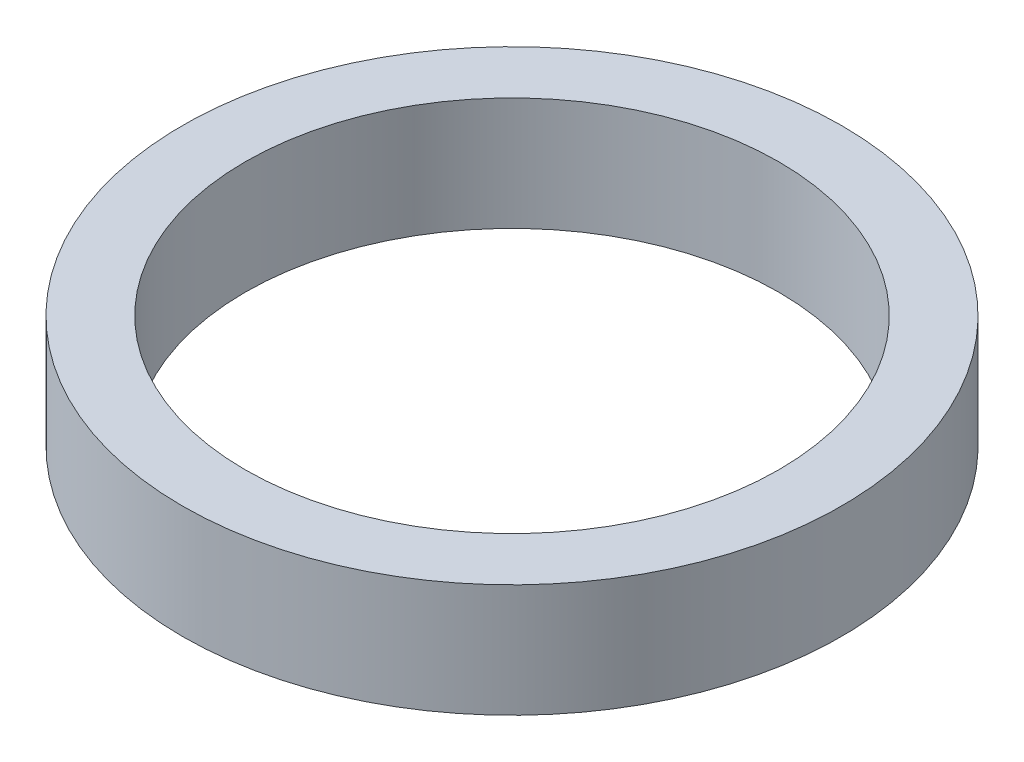
ISO-10303-21;
HEADER;
FILE_DESCRIPTION(('STEP AP214'),'2;1');
FILE_NAME('part.step','',(''),(''),'','','');
FILE_SCHEMA(('AUTOMOTIVE_DESIGN { 1 0 10303 214 1 1 1 1 }'));
ENDSEC;
DATA;
#1=APPLICATION_CONTEXT('core data for automotive mechanical design processes');
#2=APPLICATION_PROTOCOL_DEFINITION('international standard','automotive_design',2000,#1);
#3=PRODUCT_CONTEXT('',#1,'mechanical');
#4=PRODUCT('Part','Part','',(#3));
#5=PRODUCT_RELATED_PRODUCT_CATEGORY('part','',(#4));
#6=PRODUCT_DEFINITION_FORMATION('','',#4);
#7=PRODUCT_DEFINITION_CONTEXT('part definition',#1,'design');
#8=PRODUCT_DEFINITION('design','',#6,#7);
#9=PRODUCT_DEFINITION_SHAPE('','',#8);
#10=(LENGTH_UNIT() NAMED_UNIT(*) SI_UNIT(.MILLI.,.METRE.));
#11=(NAMED_UNIT(*) PLANE_ANGLE_UNIT() SI_UNIT($,.RADIAN.));
#12=(NAMED_UNIT(*) SI_UNIT($,.STERADIAN.) SOLID_ANGLE_UNIT());
#13=UNCERTAINTY_MEASURE_WITH_UNIT(LENGTH_MEASURE(1.E-05),#10,'distance_accuracy_value','');
#14=(GEOMETRIC_REPRESENTATION_CONTEXT(3) GLOBAL_UNCERTAINTY_ASSIGNED_CONTEXT((#13)) GLOBAL_UNIT_ASSIGNED_CONTEXT((#10,
#11,#12)) REPRESENTATION_CONTEXT('',''));
#15=CARTESIAN_POINT('',(0.,0.,0.));
#16=DIRECTION('',(0.,0.,1.));
#17=DIRECTION('',(1.,0.,0.));
#18=AXIS2_PLACEMENT_3D('',#15,#16,#17);
#19=CARTESIAN_POINT('',(0.,18.,0.));
#20=DIRECTION('',(0.,-1.,0.));
#21=DIRECTION('',(0.,0.,-1.));
#22=AXIS2_PLACEMENT_3D('',#19,#20,#21);
#23=CYLINDRICAL_SURFACE('',#22,52.5);
#24=CARTESIAN_POINT('',(0.,18.,0.));
#25=DIRECTION('',(0.,1.,0.));
#26=DIRECTION('',(0.,0.,1.));
#27=AXIS2_PLACEMENT_3D('',#24,#25,#26);
#28=CIRCLE('',#27,52.5);
#29=CARTESIAN_POINT('',(0.,18.,52.5));
#30=VERTEX_POINT('',#29);
#31=EDGE_CURVE('E10',#30,#30,#28,.T.);
#32=ORIENTED_EDGE('',*,*,#31,.F.);
#33=EDGE_LOOP('',(#32));
#34=FACE_BOUND('',#33,.T.);
#35=CARTESIAN_POINT('',(0.,0.,0.));
#36=DIRECTION('',(0.,1.,0.));
#37=DIRECTION('',(0.,0.,1.));
#38=AXIS2_PLACEMENT_3D('',#35,#36,#37);
#39=CIRCLE('',#38,52.5);
#40=CARTESIAN_POINT('',(0.,0.,52.5));
#41=VERTEX_POINT('',#40);
#42=EDGE_CURVE('E37',#41,#41,#39,.T.);
#43=ORIENTED_EDGE('',*,*,#42,.T.);
#44=EDGE_LOOP('',(#43));
#45=FACE_BOUND('',#44,.T.);
#46=ADVANCED_FACE('F40',(#34,#45),#23,.T.);
#47=CARTESIAN_POINT('',(0.,18.,0.));
#48=DIRECTION('',(0.,1.,0.));
#49=DIRECTION('',(0.,0.,1.));
#50=AXIS2_PLACEMENT_3D('',#47,#48,#49);
#51=PLANE('',#50);
#52=CARTESIAN_POINT('',(0.,18.,0.));
#53=DIRECTION('',(0.,1.,0.));
#54=DIRECTION('',(0.,0.,1.));
#55=AXIS2_PLACEMENT_3D('',#52,#53,#54);
#56=CIRCLE('',#55,42.5);
#57=CARTESIAN_POINT('',(0.,18.,42.5));
#58=VERTEX_POINT('',#57);
#59=EDGE_CURVE('E50',#58,#58,#56,.T.);
#60=ORIENTED_EDGE('',*,*,#59,.F.);
#61=EDGE_LOOP('',(#60));
#62=FACE_BOUND('',#61,.T.);
#63=ORIENTED_EDGE('',*,*,#31,.T.);
#64=EDGE_LOOP('',(#63));
#65=FACE_BOUND('',#64,.T.);
#66=ADVANCED_FACE('F59',(#62,#65),#51,.T.);
#67=CARTESIAN_POINT('',(0.,0.,0.));
#68=DIRECTION('',(0.,1.,0.));
#69=DIRECTION('',(0.,0.,1.));
#70=AXIS2_PLACEMENT_3D('',#67,#68,#69);
#71=PLANE('',#70);
#72=CARTESIAN_POINT('',(0.,0.,0.));
#73=DIRECTION('',(0.,1.,0.));
#74=DIRECTION('',(0.,0.,1.));
#75=AXIS2_PLACEMENT_3D('',#72,#73,#74);
#76=CIRCLE('',#75,42.5);
#77=CARTESIAN_POINT('',(0.,0.,42.5));
#78=VERTEX_POINT('',#77);
#79=EDGE_CURVE('E47',#78,#78,#76,.T.);
#80=ORIENTED_EDGE('',*,*,#79,.T.);
#81=EDGE_LOOP('',(#80));
#82=FACE_BOUND('',#81,.T.);
#83=ORIENTED_EDGE('',*,*,#42,.F.);
#84=EDGE_LOOP('',(#83));
#85=FACE_BOUND('',#84,.T.);
#86=ADVANCED_FACE('F58',(#82,#85),#71,.F.);
#87=CARTESIAN_POINT('',(0.,18.,0.));
#88=DIRECTION('',(0.,-1.,0.));
#89=DIRECTION('',(0.,0.,-1.));
#90=AXIS2_PLACEMENT_3D('',#87,#88,#89);
#91=CYLINDRICAL_SURFACE('',#90,42.5);
#92=ORIENTED_EDGE('',*,*,#59,.T.);
#93=EDGE_LOOP('',(#92));
#94=FACE_BOUND('',#93,.T.);
#95=ORIENTED_EDGE('',*,*,#79,.F.);
#96=EDGE_LOOP('',(#95));
#97=FACE_BOUND('',#96,.T.);
#98=ADVANCED_FACE('F54',(#94,#97),#91,.F.);
#99=CLOSED_SHELL('',(#46,#66,#86,#98));
#100=MANIFOLD_SOLID_BREP('B2',#99);
#101=ADVANCED_BREP_SHAPE_REPRESENTATION('',(#18,#100),#14);
#102=SHAPE_DEFINITION_REPRESENTATION(#9,#101);
ENDSEC;
END-ISO-10303-21;
